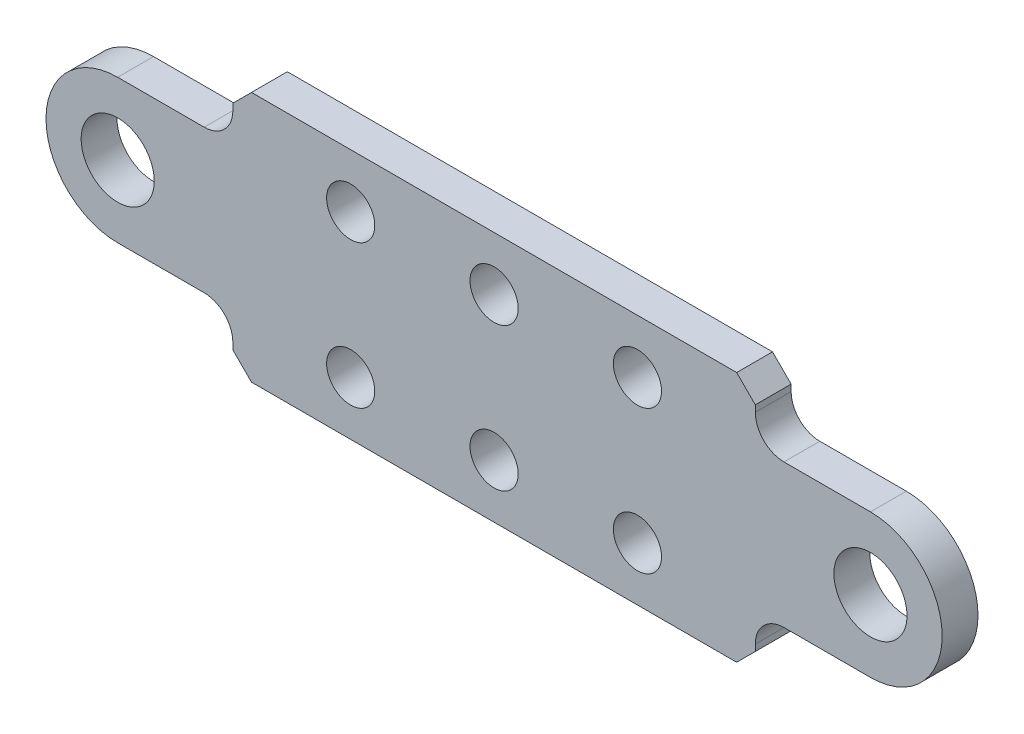
ISO-10303-21;
HEADER;
FILE_DESCRIPTION(('STEP AP214'),'2;1');
FILE_NAME('part.step','',(''),(''),'','','');
FILE_SCHEMA(('AUTOMOTIVE_DESIGN { 1 0 10303 214 1 1 1 1 }'));
ENDSEC;
DATA;
#1=APPLICATION_CONTEXT('core data for automotive mechanical design processes');
#2=APPLICATION_PROTOCOL_DEFINITION('international standard','automotive_design',2000,#1);
#3=PRODUCT_CONTEXT('',#1,'mechanical');
#4=PRODUCT('Part','Part','',(#3));
#5=PRODUCT_RELATED_PRODUCT_CATEGORY('part','',(#4));
#6=PRODUCT_DEFINITION_FORMATION('','',#4);
#7=PRODUCT_DEFINITION_CONTEXT('part definition',#1,'design');
#8=PRODUCT_DEFINITION('design','',#6,#7);
#9=PRODUCT_DEFINITION_SHAPE('','',#8);
#10=(LENGTH_UNIT() NAMED_UNIT(*) SI_UNIT(.MILLI.,.METRE.));
#11=(NAMED_UNIT(*) PLANE_ANGLE_UNIT() SI_UNIT($,.RADIAN.));
#12=(NAMED_UNIT(*) SI_UNIT($,.STERADIAN.) SOLID_ANGLE_UNIT());
#13=UNCERTAINTY_MEASURE_WITH_UNIT(LENGTH_MEASURE(1.E-05),#10,'distance_accuracy_value','');
#14=(GEOMETRIC_REPRESENTATION_CONTEXT(3) GLOBAL_UNCERTAINTY_ASSIGNED_CONTEXT((#13)) GLOBAL_UNIT_ASSIGNED_CONTEXT((#10,
#11,#12)) REPRESENTATION_CONTEXT('',''));
#15=CARTESIAN_POINT('',(0.,0.,0.));
#16=DIRECTION('',(0.,0.,1.));
#17=DIRECTION('',(1.,0.,0.));
#18=AXIS2_PLACEMENT_3D('',#15,#16,#17);
#19=CARTESIAN_POINT('',(23.1375955865752,0.,0.));
#20=DIRECTION('',(-1.,0.,0.));
#21=DIRECTION('',(0.,0.,1.));
#22=AXIS2_PLACEMENT_3D('',#19,#20,#21);
#23=PLANE('',#22);
#24=DIRECTION('',(0.,0.,-1.));
#25=VECTOR('',#24,1.);
#26=CARTESIAN_POINT('',(23.1375955865752,-8.89,0.));
#27=LINE('',#26,#25);
#28=CARTESIAN_POINT('',(23.1375955865752,-8.89,0.));
#29=VERTEX_POINT('',#28);
#30=CARTESIAN_POINT('',(23.1375955865752,-8.89,3.175));
#31=VERTEX_POINT('',#30);
#32=EDGE_CURVE('E167',#29,#31,#27,.F.);
#33=ORIENTED_EDGE('',*,*,#32,.T.);
#34=DIRECTION('',(0.,1.,0.));
#35=VECTOR('',#34,1.);
#36=CARTESIAN_POINT('',(23.1375955865752,0.,3.175));
#37=LINE('',#36,#35);
#38=CARTESIAN_POINT('',(23.1375955865752,-9.4615,3.175));
#39=VERTEX_POINT('',#38);
#40=EDGE_CURVE('E151',#39,#31,#37,.T.);
#41=ORIENTED_EDGE('',*,*,#40,.F.);
#42=DIRECTION('',(0.,0.,1.));
#43=VECTOR('',#42,1.);
#44=CARTESIAN_POINT('',(23.1375955865752,-9.4615,3.175));
#45=LINE('',#44,#43);
#46=CARTESIAN_POINT('',(23.1375955865752,-9.4615,0.));
#47=VERTEX_POINT('',#46);
#48=EDGE_CURVE('E185',#39,#47,#45,.F.);
#49=ORIENTED_EDGE('',*,*,#48,.T.);
#50=DIRECTION('',(0.,1.,0.));
#51=VECTOR('',#50,1.);
#52=CARTESIAN_POINT('',(23.1375955865752,0.,0.));
#53=LINE('',#52,#51);
#54=EDGE_CURVE('E219',#29,#47,#53,.F.);
#55=ORIENTED_EDGE('',*,*,#54,.F.);
#56=EDGE_LOOP('',(#33,#41,#49,#55));
#57=FACE_BOUND('',#56,.T.);
#58=ADVANCED_FACE('F17',(#57),#23,.F.);
#59=CARTESIAN_POINT('',(23.1375955865752,0.,0.));
#60=DIRECTION('',(1.,0.,0.));
#61=DIRECTION('',(0.,0.,-1.));
#62=AXIS2_PLACEMENT_3D('',#59,#60,#61);
#63=PLANE('',#62);
#64=DIRECTION('',(0.,1.,0.));
#65=VECTOR('',#64,1.);
#66=CARTESIAN_POINT('',(23.1375955865752,0.,0.));
#67=LINE('',#66,#65);
#68=CARTESIAN_POINT('',(23.1375955865752,8.89,0.));
#69=VERTEX_POINT('',#68);
#70=CARTESIAN_POINT('',(23.1375955865752,9.4615,0.));
#71=VERTEX_POINT('',#70);
#72=EDGE_CURVE('E215',#69,#71,#67,.T.);
#73=ORIENTED_EDGE('',*,*,#72,.T.);
#74=DIRECTION('',(0.,0.,1.));
#75=VECTOR('',#74,1.);
#76=CARTESIAN_POINT('',(23.1375955865752,9.4615,0.));
#77=LINE('',#76,#75);
#78=CARTESIAN_POINT('',(23.1375955865752,9.4615,3.175));
#79=VERTEX_POINT('',#78);
#80=EDGE_CURVE('E242',#71,#79,#77,.T.);
#81=ORIENTED_EDGE('',*,*,#80,.T.);
#82=DIRECTION('',(0.,1.,0.));
#83=VECTOR('',#82,1.);
#84=CARTESIAN_POINT('',(23.1375955865752,0.,3.175));
#85=LINE('',#84,#83);
#86=CARTESIAN_POINT('',(23.1375955865752,8.89,3.175));
#87=VERTEX_POINT('',#86);
#88=EDGE_CURVE('E188',#87,#79,#85,.T.);
#89=ORIENTED_EDGE('',*,*,#88,.F.);
#90=DIRECTION('',(0.,0.,-1.));
#91=VECTOR('',#90,1.);
#92=CARTESIAN_POINT('',(23.1375955865752,8.89,0.));
#93=LINE('',#92,#91);
#94=EDGE_CURVE('E247',#87,#69,#93,.T.);
#95=ORIENTED_EDGE('',*,*,#94,.T.);
#96=EDGE_LOOP('',(#73,#81,#89,#95));
#97=FACE_BOUND('',#96,.T.);
#98=ADVANCED_FACE('F660',(#97),#63,.T.);
#99=CARTESIAN_POINT('',(-23.1375955865752,0.,0.));
#100=DIRECTION('',(1.,0.,0.));
#101=DIRECTION('',(0.,0.,-1.));
#102=AXIS2_PLACEMENT_3D('',#99,#100,#101);
#103=PLANE('',#102);
#104=DIRECTION('',(0.,0.,-1.));
#105=VECTOR('',#104,1.);
#106=CARTESIAN_POINT('',(-23.1375955865752,8.89,0.));
#107=LINE('',#106,#105);
#108=CARTESIAN_POINT('',(-23.1375955865752,8.89,0.));
#109=VERTEX_POINT('',#108);
#110=CARTESIAN_POINT('',(-23.1375955865752,8.89,3.175));
#111=VERTEX_POINT('',#110);
#112=EDGE_CURVE('E342',#109,#111,#107,.F.);
#113=ORIENTED_EDGE('',*,*,#112,.T.);
#114=DIRECTION('',(0.,1.,0.));
#115=VECTOR('',#114,1.);
#116=CARTESIAN_POINT('',(-23.1375955865752,0.,3.175));
#117=LINE('',#116,#115);
#118=CARTESIAN_POINT('',(-23.1375955865752,9.4615,3.175));
#119=VERTEX_POINT('',#118);
#120=EDGE_CURVE('E186',#119,#111,#117,.F.);
#121=ORIENTED_EDGE('',*,*,#120,.F.);
#122=DIRECTION('',(0.,0.,1.));
#123=VECTOR('',#122,1.);
#124=CARTESIAN_POINT('',(-23.1375955865752,9.4615,3.175));
#125=LINE('',#124,#123);
#126=CARTESIAN_POINT('',(-23.1375955865752,9.4615,0.));
#127=VERTEX_POINT('',#126);
#128=EDGE_CURVE('E228',#127,#119,#125,.T.);
#129=ORIENTED_EDGE('',*,*,#128,.F.);
#130=DIRECTION('',(0.,1.,0.));
#131=VECTOR('',#130,1.);
#132=CARTESIAN_POINT('',(-23.1375955865752,0.,0.));
#133=LINE('',#132,#131);
#134=EDGE_CURVE('E203',#109,#127,#133,.T.);
#135=ORIENTED_EDGE('',*,*,#134,.F.);
#136=EDGE_LOOP('',(#113,#121,#129,#135));
#137=FACE_BOUND('',#136,.T.);
#138=ADVANCED_FACE('F651',(#137),#103,.F.);
#139=CARTESIAN_POINT('',(-23.1375955865752,0.,0.));
#140=DIRECTION('',(-1.,0.,0.));
#141=DIRECTION('',(0.,0.,1.));
#142=AXIS2_PLACEMENT_3D('',#139,#140,#141);
#143=PLANE('',#142);
#144=DIRECTION('',(0.,1.,0.));
#145=VECTOR('',#144,1.);
#146=CARTESIAN_POINT('',(-23.1375955865752,0.,0.));
#147=LINE('',#146,#145);
#148=CARTESIAN_POINT('',(-23.1375955865752,-8.89,0.));
#149=VERTEX_POINT('',#148);
#150=CARTESIAN_POINT('',(-23.1375955865752,-9.4615,0.));
#151=VERTEX_POINT('',#150);
#152=EDGE_CURVE('E199',#149,#151,#147,.F.);
#153=ORIENTED_EDGE('',*,*,#152,.T.);
#154=DIRECTION('',(0.,0.,1.));
#155=VECTOR('',#154,1.);
#156=CARTESIAN_POINT('',(-23.1375955865752,-9.4615,0.));
#157=LINE('',#156,#155);
#158=CARTESIAN_POINT('',(-23.1375955865752,-9.4615,3.175));
#159=VERTEX_POINT('',#158);
#160=EDGE_CURVE('E262',#159,#151,#157,.F.);
#161=ORIENTED_EDGE('',*,*,#160,.F.);
#162=DIRECTION('',(0.,1.,0.));
#163=VECTOR('',#162,1.);
#164=CARTESIAN_POINT('',(-23.1375955865752,0.,3.175));
#165=LINE('',#164,#163);
#166=CARTESIAN_POINT('',(-23.1375955865752,-8.89,3.175));
#167=VERTEX_POINT('',#166);
#168=EDGE_CURVE('E195',#167,#159,#165,.F.);
#169=ORIENTED_EDGE('',*,*,#168,.F.);
#170=DIRECTION('',(0.,0.,-1.));
#171=VECTOR('',#170,1.);
#172=CARTESIAN_POINT('',(-23.1375955865752,-8.89,0.));
#173=LINE('',#172,#171);
#174=EDGE_CURVE('E263',#167,#149,#173,.T.);
#175=ORIENTED_EDGE('',*,*,#174,.T.);
#176=EDGE_LOOP('',(#153,#161,#169,#175));
#177=FACE_BOUND('',#176,.T.);
#178=ADVANCED_FACE('F385',(#177),#143,.T.);
#179=CARTESIAN_POINT('',(0.,0.,3.175));
#180=DIRECTION('',(0.,0.,1.));
#181=DIRECTION('',(1.,0.,0.));
#182=AXIS2_PLACEMENT_3D('',#179,#180,#181);
#183=PLANE('',#182);
#184=DIRECTION('',(1.,0.,0.));
#185=VECTOR('',#184,1.);
#186=CARTESIAN_POINT('',(0.,6.35,3.175));
#187=LINE('',#186,#185);
#188=CARTESIAN_POINT('',(-25.6775955865752,6.35,3.175));
#189=VERTEX_POINT('',#188);
#190=CARTESIAN_POINT('',(-33.3375,6.35,3.175));
#191=VERTEX_POINT('',#190);
#192=EDGE_CURVE('E210',#189,#191,#187,.F.);
#193=ORIENTED_EDGE('',*,*,#192,.T.);
#194=CARTESIAN_POINT('',(-33.3375,0.,3.175));
#195=DIRECTION('',(0.,0.,-1.));
#196=DIRECTION('',(-1.,0.,0.));
#197=AXIS2_PLACEMENT_3D('',#194,#195,#196);
#198=CIRCLE('',#197,6.35);
#199=CARTESIAN_POINT('',(-33.3375,-6.35,3.175));
#200=VERTEX_POINT('',#199);
#201=EDGE_CURVE('E209',#200,#191,#198,.T.);
#202=ORIENTED_EDGE('',*,*,#201,.F.);
#203=DIRECTION('',(1.,0.,0.));
#204=VECTOR('',#203,1.);
#205=CARTESIAN_POINT('',(0.,-6.35,3.175));
#206=LINE('',#205,#204);
#207=CARTESIAN_POINT('',(-25.6775955865752,-6.34999999999999,3.175));
#208=VERTEX_POINT('',#207);
#209=EDGE_CURVE('E206',#208,#200,#206,.F.);
#210=ORIENTED_EDGE('',*,*,#209,.F.);
#211=CARTESIAN_POINT('',(-25.6775955865752,-8.89,3.175));
#212=DIRECTION('',(0.,0.,-1.));
#213=DIRECTION('',(-1.,0.,0.));
#214=AXIS2_PLACEMENT_3D('',#211,#212,#213);
#215=CIRCLE('',#214,2.54);
#216=EDGE_CURVE('E335',#208,#167,#215,.T.);
#217=ORIENTED_EDGE('',*,*,#216,.T.);
#218=ORIENTED_EDGE('',*,*,#168,.T.);
#219=DIRECTION('',(0.707106781186548,-0.707106781186548,0.));
#220=VECTOR('',#219,1.);
#221=CARTESIAN_POINT('',(-23.1375955865752,-9.4615,3.175));
#222=LINE('',#221,#220);
#223=CARTESIAN_POINT('',(-21.4865955865752,-11.1125,3.175));
#224=VERTEX_POINT('',#223);
#225=EDGE_CURVE('E259',#224,#159,#222,.F.);
#226=ORIENTED_EDGE('',*,*,#225,.F.);
#227=DIRECTION('',(1.,0.,0.));
#228=VECTOR('',#227,1.);
#229=CARTESIAN_POINT('',(0.,-11.1125,3.175));
#230=LINE('',#229,#228);
#231=CARTESIAN_POINT('',(21.4865955865752,-11.1125,3.175));
#232=VERTEX_POINT('',#231);
#233=EDGE_CURVE('E334',#224,#232,#230,.T.);
#234=ORIENTED_EDGE('',*,*,#233,.T.);
#235=DIRECTION('',(-0.707106781186548,-0.707106781186548,0.));
#236=VECTOR('',#235,1.);
#237=CARTESIAN_POINT('',(21.4865955865752,-11.1125,3.175));
#238=LINE('',#237,#236);
#239=EDGE_CURVE('E252',#232,#39,#238,.F.);
#240=ORIENTED_EDGE('',*,*,#239,.T.);
#241=ORIENTED_EDGE('',*,*,#40,.T.);
#242=CARTESIAN_POINT('',(25.6775955865752,-8.89,3.175));
#243=DIRECTION('',(0.,0.,-1.));
#244=DIRECTION('',(-1.,0.,0.));
#245=AXIS2_PLACEMENT_3D('',#242,#243,#244);
#246=CIRCLE('',#245,2.54);
#247=CARTESIAN_POINT('',(25.6775955865752,-6.35,3.175));
#248=VERTEX_POINT('',#247);
#249=EDGE_CURVE('E154',#31,#248,#246,.T.);
#250=ORIENTED_EDGE('',*,*,#249,.T.);
#251=DIRECTION('',(1.,0.,0.));
#252=VECTOR('',#251,1.);
#253=CARTESIAN_POINT('',(0.,-6.35,3.175));
#254=LINE('',#253,#252);
#255=CARTESIAN_POINT('',(33.3375,-6.34999999999999,3.175));
#256=VERTEX_POINT('',#255);
#257=EDGE_CURVE('E160',#248,#256,#254,.T.);
#258=ORIENTED_EDGE('',*,*,#257,.T.);
#259=CARTESIAN_POINT('',(33.3375,0.,3.175));
#260=DIRECTION('',(0.,0.,-1.));
#261=DIRECTION('',(-1.,0.,0.));
#262=AXIS2_PLACEMENT_3D('',#259,#260,#261);
#263=CIRCLE('',#262,6.35);
#264=CARTESIAN_POINT('',(33.3375,6.35,3.175));
#265=VERTEX_POINT('',#264);
#266=EDGE_CURVE('E174',#265,#256,#263,.T.);
#267=ORIENTED_EDGE('',*,*,#266,.F.);
#268=DIRECTION('',(1.,0.,0.));
#269=VECTOR('',#268,1.);
#270=CARTESIAN_POINT('',(0.,6.35,3.175));
#271=LINE('',#270,#269);
#272=CARTESIAN_POINT('',(25.6775955865752,6.34999999999999,3.175));
#273=VERTEX_POINT('',#272);
#274=EDGE_CURVE('E222',#273,#265,#271,.T.);
#275=ORIENTED_EDGE('',*,*,#274,.F.);
#276=CARTESIAN_POINT('',(25.6775955865752,8.89,3.175));
#277=DIRECTION('',(0.,0.,-1.));
#278=DIRECTION('',(-1.,0.,0.));
#279=AXIS2_PLACEMENT_3D('',#276,#277,#278);
#280=CIRCLE('',#279,2.54);
#281=EDGE_CURVE('E343',#273,#87,#280,.T.);
#282=ORIENTED_EDGE('',*,*,#281,.T.);
#283=ORIENTED_EDGE('',*,*,#88,.T.);
#284=DIRECTION('',(0.707106781186548,-0.707106781186548,0.));
#285=VECTOR('',#284,1.);
#286=CARTESIAN_POINT('',(23.1375955865752,9.4615,3.175));
#287=LINE('',#286,#285);
#288=CARTESIAN_POINT('',(21.4865955865752,11.1125,3.175));
#289=VERTEX_POINT('',#288);
#290=EDGE_CURVE('E238',#79,#289,#287,.F.);
#291=ORIENTED_EDGE('',*,*,#290,.T.);
#292=DIRECTION('',(1.,0.,0.));
#293=VECTOR('',#292,1.);
#294=CARTESIAN_POINT('',(0.,11.1125,3.175));
#295=LINE('',#294,#293);
#296=CARTESIAN_POINT('',(-21.4865955865752,11.1125,3.175));
#297=VERTEX_POINT('',#296);
#298=EDGE_CURVE('E241',#297,#289,#295,.T.);
#299=ORIENTED_EDGE('',*,*,#298,.F.);
#300=DIRECTION('',(-0.707106781186548,-0.707106781186548,0.));
#301=VECTOR('',#300,1.);
#302=CARTESIAN_POINT('',(-21.4865955865752,11.1125,3.175));
#303=LINE('',#302,#301);
#304=EDGE_CURVE('E230',#119,#297,#303,.F.);
#305=ORIENTED_EDGE('',*,*,#304,.F.);
#306=ORIENTED_EDGE('',*,*,#120,.T.);
#307=CARTESIAN_POINT('',(-25.6775955865752,8.89,3.175));
#308=DIRECTION('',(0.,0.,-1.));
#309=DIRECTION('',(-1.,0.,0.));
#310=AXIS2_PLACEMENT_3D('',#307,#308,#309);
#311=CIRCLE('',#310,2.54);
#312=EDGE_CURVE('E340',#111,#189,#311,.T.);
#313=ORIENTED_EDGE('',*,*,#312,.T.);
#314=EDGE_LOOP('',(#193,#202,#210,#217,#218,#226,#234,#240,#241,#250,#258,#267,#275,#282,#283,
#291,#299,#305,#306,#313));
#315=FACE_BOUND('',#314,.T.);
#316=CARTESIAN_POINT('',(33.3375,0.,3.175));
#317=DIRECTION('',(0.,0.,-1.));
#318=DIRECTION('',(-1.,0.,0.));
#319=AXIS2_PLACEMENT_3D('',#316,#317,#318);
#320=CIRCLE('',#319,3.2385);
#321=CARTESIAN_POINT('',(30.099,0.,3.175));
#322=VERTEX_POINT('',#321);
#323=EDGE_CURVE('E256',#322,#322,#320,.T.);
#324=ORIENTED_EDGE('',*,*,#323,.T.);
#325=EDGE_LOOP('',(#324));
#326=FACE_BOUND('',#325,.T.);
#327=CARTESIAN_POINT('',(-33.3375,0.,3.175));
#328=DIRECTION('',(0.,0.,-1.));
#329=DIRECTION('',(-1.,0.,0.));
#330=AXIS2_PLACEMENT_3D('',#327,#328,#329);
#331=CIRCLE('',#330,3.2385);
#332=CARTESIAN_POINT('',(-36.576,0.,3.175));
#333=VERTEX_POINT('',#332);
#334=EDGE_CURVE('E350',#333,#333,#331,.T.);
#335=ORIENTED_EDGE('',*,*,#334,.T.);
#336=EDGE_LOOP('',(#335));
#337=FACE_BOUND('',#336,.T.);
#338=CARTESIAN_POINT('',(-12.7,-6.35,3.175));
#339=DIRECTION('',(0.,0.,-1.));
#340=DIRECTION('',(-1.,0.,0.));
#341=AXIS2_PLACEMENT_3D('',#338,#339,#340);
#342=CIRCLE('',#341,2.1336);
#343=CARTESIAN_POINT('',(-14.8336,-6.35,3.175));
#344=VERTEX_POINT('',#343);
#345=EDGE_CURVE('E353',#344,#344,#342,.T.);
#346=ORIENTED_EDGE('',*,*,#345,.T.);
#347=EDGE_LOOP('',(#346));
#348=FACE_BOUND('',#347,.T.);
#349=CARTESIAN_POINT('',(0.,-6.35,3.175));
#350=DIRECTION('',(0.,0.,-1.));
#351=DIRECTION('',(-1.,0.,0.));
#352=AXIS2_PLACEMENT_3D('',#349,#350,#351);
#353=CIRCLE('',#352,2.1336);
#354=CARTESIAN_POINT('',(-2.13360000000001,-6.35,3.175));
#355=VERTEX_POINT('',#354);
#356=EDGE_CURVE('E356',#355,#355,#353,.T.);
#357=ORIENTED_EDGE('',*,*,#356,.T.);
#358=EDGE_LOOP('',(#357));
#359=FACE_BOUND('',#358,.T.);
#360=CARTESIAN_POINT('',(12.7,-6.35,3.175));
#361=DIRECTION('',(0.,0.,-1.));
#362=DIRECTION('',(-1.,0.,0.));
#363=AXIS2_PLACEMENT_3D('',#360,#361,#362);
#364=CIRCLE('',#363,2.1336);
#365=CARTESIAN_POINT('',(10.5664,-6.35,3.175));
#366=VERTEX_POINT('',#365);
#367=EDGE_CURVE('E359',#366,#366,#364,.T.);
#368=ORIENTED_EDGE('',*,*,#367,.T.);
#369=EDGE_LOOP('',(#368));
#370=FACE_BOUND('',#369,.T.);
#371=CARTESIAN_POINT('',(12.7,6.35,3.175));
#372=DIRECTION('',(0.,0.,-1.));
#373=DIRECTION('',(-1.,0.,0.));
#374=AXIS2_PLACEMENT_3D('',#371,#372,#373);
#375=CIRCLE('',#374,2.1336);
#376=CARTESIAN_POINT('',(10.5664,6.35,3.175));
#377=VERTEX_POINT('',#376);
#378=EDGE_CURVE('E362',#377,#377,#375,.T.);
#379=ORIENTED_EDGE('',*,*,#378,.T.);
#380=EDGE_LOOP('',(#379));
#381=FACE_BOUND('',#380,.T.);
#382=CARTESIAN_POINT('',(0.,6.35,3.175));
#383=DIRECTION('',(0.,0.,-1.));
#384=DIRECTION('',(-1.,0.,0.));
#385=AXIS2_PLACEMENT_3D('',#382,#383,#384);
#386=CIRCLE('',#385,2.1336);
#387=CARTESIAN_POINT('',(-2.13360000000001,6.35,3.175));
#388=VERTEX_POINT('',#387);
#389=EDGE_CURVE('E364',#388,#388,#386,.T.);
#390=ORIENTED_EDGE('',*,*,#389,.T.);
#391=EDGE_LOOP('',(#390));
#392=FACE_BOUND('',#391,.T.);
#393=CARTESIAN_POINT('',(-12.7,6.35,3.175));
#394=DIRECTION('',(0.,0.,-1.));
#395=DIRECTION('',(-1.,0.,0.));
#396=AXIS2_PLACEMENT_3D('',#393,#394,#395);
#397=CIRCLE('',#396,2.1336);
#398=CARTESIAN_POINT('',(-14.8336,6.35,3.175));
#399=VERTEX_POINT('',#398);
#400=EDGE_CURVE('E20',#399,#399,#397,.T.);
#401=ORIENTED_EDGE('',*,*,#400,.T.);
#402=EDGE_LOOP('',(#401));
#403=FACE_BOUND('',#402,.T.);
#404=ADVANCED_FACE('F157',(#315,#326,#337,#348,#359,#370,#381,#392,#403),#183,.T.);
#405=CARTESIAN_POINT('',(-12.7,6.35,3.175));
#406=DIRECTION('',(0.,0.,-1.));
#407=DIRECTION('',(-1.,0.,0.));
#408=AXIS2_PLACEMENT_3D('',#405,#406,#407);
#409=CYLINDRICAL_SURFACE('',#408,2.1336);
#410=CARTESIAN_POINT('',(-12.7,6.35,0.));
#411=DIRECTION('',(0.,0.,-1.));
#412=DIRECTION('',(-1.,0.,0.));
#413=AXIS2_PLACEMENT_3D('',#410,#411,#412);
#414=CIRCLE('',#413,2.1336);
#415=CARTESIAN_POINT('',(-14.8336,6.35,0.));
#416=VERTEX_POINT('',#415);
#417=EDGE_CURVE('E331',#416,#416,#414,.T.);
#418=ORIENTED_EDGE('',*,*,#417,.T.);
#419=EDGE_LOOP('',(#418));
#420=FACE_BOUND('',#419,.T.);
#421=ORIENTED_EDGE('',*,*,#400,.F.);
#422=EDGE_LOOP('',(#421));
#423=FACE_BOUND('',#422,.T.);
#424=ADVANCED_FACE('F372',(#420,#423),#409,.F.);
#425=CARTESIAN_POINT('',(0.,6.35,3.175));
#426=DIRECTION('',(0.,0.,-1.));
#427=DIRECTION('',(-1.,0.,0.));
#428=AXIS2_PLACEMENT_3D('',#425,#426,#427);
#429=CYLINDRICAL_SURFACE('',#428,2.1336);
#430=CARTESIAN_POINT('',(0.,6.35,0.));
#431=DIRECTION('',(0.,0.,-1.));
#432=DIRECTION('',(-1.,0.,0.));
#433=AXIS2_PLACEMENT_3D('',#430,#431,#432);
#434=CIRCLE('',#433,2.1336);
#435=CARTESIAN_POINT('',(-2.13360000000001,6.35,0.));
#436=VERTEX_POINT('',#435);
#437=EDGE_CURVE('E328',#436,#436,#434,.T.);
#438=ORIENTED_EDGE('',*,*,#437,.T.);
#439=EDGE_LOOP('',(#438));
#440=FACE_BOUND('',#439,.T.);
#441=ORIENTED_EDGE('',*,*,#389,.F.);
#442=EDGE_LOOP('',(#441));
#443=FACE_BOUND('',#442,.T.);
#444=ADVANCED_FACE('F374',(#440,#443),#429,.F.);
#445=CARTESIAN_POINT('',(12.7,6.35,3.175));
#446=DIRECTION('',(0.,0.,-1.));
#447=DIRECTION('',(-1.,0.,0.));
#448=AXIS2_PLACEMENT_3D('',#445,#446,#447);
#449=CYLINDRICAL_SURFACE('',#448,2.1336);
#450=CARTESIAN_POINT('',(12.7,6.35,0.));
#451=DIRECTION('',(0.,0.,-1.));
#452=DIRECTION('',(-1.,0.,0.));
#453=AXIS2_PLACEMENT_3D('',#450,#451,#452);
#454=CIRCLE('',#453,2.1336);
#455=CARTESIAN_POINT('',(10.5664,6.35,0.));
#456=VERTEX_POINT('',#455);
#457=EDGE_CURVE('E325',#456,#456,#454,.T.);
#458=ORIENTED_EDGE('',*,*,#457,.T.);
#459=EDGE_LOOP('',(#458));
#460=FACE_BOUND('',#459,.T.);
#461=ORIENTED_EDGE('',*,*,#378,.F.);
#462=EDGE_LOOP('',(#461));
#463=FACE_BOUND('',#462,.T.);
#464=ADVANCED_FACE('F382',(#460,#463),#449,.F.);
#465=CARTESIAN_POINT('',(12.7,-6.35,3.175));
#466=DIRECTION('',(0.,0.,-1.));
#467=DIRECTION('',(-1.,0.,0.));
#468=AXIS2_PLACEMENT_3D('',#465,#466,#467);
#469=CYLINDRICAL_SURFACE('',#468,2.1336);
#470=CARTESIAN_POINT('',(12.7,-6.35,0.));
#471=DIRECTION('',(0.,0.,-1.));
#472=DIRECTION('',(-1.,0.,0.));
#473=AXIS2_PLACEMENT_3D('',#470,#471,#472);
#474=CIRCLE('',#473,2.1336);
#475=CARTESIAN_POINT('',(10.5664,-6.35,0.));
#476=VERTEX_POINT('',#475);
#477=EDGE_CURVE('E322',#476,#476,#474,.T.);
#478=ORIENTED_EDGE('',*,*,#477,.T.);
#479=EDGE_LOOP('',(#478));
#480=FACE_BOUND('',#479,.T.);
#481=ORIENTED_EDGE('',*,*,#367,.F.);
#482=EDGE_LOOP('',(#481));
#483=FACE_BOUND('',#482,.T.);
#484=ADVANCED_FACE('F470',(#480,#483),#469,.F.);
#485=CARTESIAN_POINT('',(0.,-6.35,3.175));
#486=DIRECTION('',(0.,0.,-1.));
#487=DIRECTION('',(-1.,0.,0.));
#488=AXIS2_PLACEMENT_3D('',#485,#486,#487);
#489=CYLINDRICAL_SURFACE('',#488,2.1336);
#490=CARTESIAN_POINT('',(0.,-6.35,0.));
#491=DIRECTION('',(0.,0.,-1.));
#492=DIRECTION('',(-1.,0.,0.));
#493=AXIS2_PLACEMENT_3D('',#490,#491,#492);
#494=CIRCLE('',#493,2.1336);
#495=CARTESIAN_POINT('',(-2.13360000000001,-6.35,0.));
#496=VERTEX_POINT('',#495);
#497=EDGE_CURVE('E319',#496,#496,#494,.T.);
#498=ORIENTED_EDGE('',*,*,#497,.T.);
#499=EDGE_LOOP('',(#498));
#500=FACE_BOUND('',#499,.T.);
#501=ORIENTED_EDGE('',*,*,#356,.F.);
#502=EDGE_LOOP('',(#501));
#503=FACE_BOUND('',#502,.T.);
#504=ADVANCED_FACE('F466',(#500,#503),#489,.F.);
#505=CARTESIAN_POINT('',(-12.7,-6.35,3.175));
#506=DIRECTION('',(0.,0.,-1.));
#507=DIRECTION('',(-1.,0.,0.));
#508=AXIS2_PLACEMENT_3D('',#505,#506,#507);
#509=CYLINDRICAL_SURFACE('',#508,2.1336);
#510=CARTESIAN_POINT('',(-12.7,-6.35,0.));
#511=DIRECTION('',(0.,0.,-1.));
#512=DIRECTION('',(-1.,0.,0.));
#513=AXIS2_PLACEMENT_3D('',#510,#511,#512);
#514=CIRCLE('',#513,2.1336);
#515=CARTESIAN_POINT('',(-14.8336,-6.35,0.));
#516=VERTEX_POINT('',#515);
#517=EDGE_CURVE('E316',#516,#516,#514,.T.);
#518=ORIENTED_EDGE('',*,*,#517,.T.);
#519=EDGE_LOOP('',(#518));
#520=FACE_BOUND('',#519,.T.);
#521=ORIENTED_EDGE('',*,*,#345,.F.);
#522=EDGE_LOOP('',(#521));
#523=FACE_BOUND('',#522,.T.);
#524=ADVANCED_FACE('F462',(#520,#523),#509,.F.);
#525=CARTESIAN_POINT('',(-33.3375,0.,3.175));
#526=DIRECTION('',(0.,0.,-1.));
#527=DIRECTION('',(-1.,0.,0.));
#528=AXIS2_PLACEMENT_3D('',#525,#526,#527);
#529=CYLINDRICAL_SURFACE('',#528,3.2385);
#530=CARTESIAN_POINT('',(-33.3375,0.,0.));
#531=DIRECTION('',(0.,0.,-1.));
#532=DIRECTION('',(-1.,0.,0.));
#533=AXIS2_PLACEMENT_3D('',#530,#531,#532);
#534=CIRCLE('',#533,3.2385);
#535=CARTESIAN_POINT('',(-36.576,0.,0.));
#536=VERTEX_POINT('',#535);
#537=EDGE_CURVE('E313',#536,#536,#534,.T.);
#538=ORIENTED_EDGE('',*,*,#537,.T.);
#539=EDGE_LOOP('',(#538));
#540=FACE_BOUND('',#539,.T.);
#541=ORIENTED_EDGE('',*,*,#334,.F.);
#542=EDGE_LOOP('',(#541));
#543=FACE_BOUND('',#542,.T.);
#544=ADVANCED_FACE('F458',(#540,#543),#529,.F.);
#545=CARTESIAN_POINT('',(33.3375,0.,3.175));
#546=DIRECTION('',(0.,0.,-1.));
#547=DIRECTION('',(-1.,0.,0.));
#548=AXIS2_PLACEMENT_3D('',#545,#546,#547);
#549=CYLINDRICAL_SURFACE('',#548,3.2385);
#550=CARTESIAN_POINT('',(33.3375,0.,0.));
#551=DIRECTION('',(0.,0.,-1.));
#552=DIRECTION('',(-1.,0.,0.));
#553=AXIS2_PLACEMENT_3D('',#550,#551,#552);
#554=CIRCLE('',#553,3.2385);
#555=CARTESIAN_POINT('',(30.099,0.,0.));
#556=VERTEX_POINT('',#555);
#557=EDGE_CURVE('E292',#556,#556,#554,.T.);
#558=ORIENTED_EDGE('',*,*,#557,.T.);
#559=EDGE_LOOP('',(#558));
#560=FACE_BOUND('',#559,.T.);
#561=ORIENTED_EDGE('',*,*,#323,.F.);
#562=EDGE_LOOP('',(#561));
#563=FACE_BOUND('',#562,.T.);
#564=ADVANCED_FACE('F454',(#560,#563),#549,.F.);
#565=CARTESIAN_POINT('',(21.4865955865752,-11.1125,3.175));
#566=DIRECTION('',(-0.707106781186548,0.707106781186548,0.));
#567=DIRECTION('',(-0.707106781186548,-0.707106781186548,0.));
#568=AXIS2_PLACEMENT_3D('',#565,#566,#567);
#569=PLANE('',#568);
#570=ORIENTED_EDGE('',*,*,#48,.F.);
#571=ORIENTED_EDGE('',*,*,#239,.F.);
#572=DIRECTION('',(0.,0.,1.));
#573=VECTOR('',#572,1.);
#574=CARTESIAN_POINT('',(21.4865955865752,-11.1125,3.175));
#575=LINE('',#574,#573);
#576=CARTESIAN_POINT('',(21.4865955865752,-11.1125,0.));
#577=VERTEX_POINT('',#576);
#578=EDGE_CURVE('E268',#232,#577,#575,.F.);
#579=ORIENTED_EDGE('',*,*,#578,.T.);
#580=DIRECTION('',(0.707106781186547,0.707106781186547,0.));
#581=VECTOR('',#580,1.);
#582=CARTESIAN_POINT('',(21.4865955865752,-11.1125,0.));
#583=LINE('',#582,#581);
#584=EDGE_CURVE('E289',#577,#47,#583,.T.);
#585=ORIENTED_EDGE('',*,*,#584,.T.);
#586=EDGE_LOOP('',(#570,#571,#579,#585));
#587=FACE_BOUND('',#586,.T.);
#588=ADVANCED_FACE('F451',(#587),#569,.F.);
#589=CARTESIAN_POINT('',(25.6775955865752,-8.89,0.));
#590=DIRECTION('',(0.,0.,-1.));
#591=DIRECTION('',(-1.,0.,0.));
#592=AXIS2_PLACEMENT_3D('',#589,#590,#591);
#593=CYLINDRICAL_SURFACE('',#592,2.54);
#594=DIRECTION('',(0.,0.,1.));
#595=VECTOR('',#594,1.);
#596=CARTESIAN_POINT('',(25.6775955865752,-6.35,0.));
#597=LINE('',#596,#595);
#598=CARTESIAN_POINT('',(25.6775955865752,-6.35,0.));
#599=VERTEX_POINT('',#598);
#600=EDGE_CURVE('E166',#599,#248,#597,.T.);
#601=ORIENTED_EDGE('',*,*,#600,.T.);
#602=ORIENTED_EDGE('',*,*,#249,.F.);
#603=ORIENTED_EDGE('',*,*,#32,.F.);
#604=CARTESIAN_POINT('',(25.6775955865752,-8.89,0.));
#605=DIRECTION('',(0.,0.,-1.));
#606=DIRECTION('',(-1.,0.,0.));
#607=AXIS2_PLACEMENT_3D('',#604,#605,#606);
#608=CIRCLE('',#607,2.54);
#609=EDGE_CURVE('E179',#29,#599,#608,.T.);
#610=ORIENTED_EDGE('',*,*,#609,.T.);
#611=EDGE_LOOP('',(#601,#602,#603,#610));
#612=FACE_BOUND('',#611,.T.);
#613=ADVANCED_FACE('F177',(#612),#593,.F.);
#614=CARTESIAN_POINT('',(0.,-6.35,0.));
#615=DIRECTION('',(0.,1.,0.));
#616=DIRECTION('',(0.,0.,1.));
#617=AXIS2_PLACEMENT_3D('',#614,#615,#616);
#618=PLANE('',#617);
#619=ORIENTED_EDGE('',*,*,#600,.F.);
#620=DIRECTION('',(1.,0.,0.));
#621=VECTOR('',#620,1.);
#622=CARTESIAN_POINT('',(0.,-6.35,0.));
#623=LINE('',#622,#621);
#624=CARTESIAN_POINT('',(33.3375,-6.34999999999999,0.));
#625=VERTEX_POINT('',#624);
#626=EDGE_CURVE('E309',#599,#625,#623,.T.);
#627=ORIENTED_EDGE('',*,*,#626,.T.);
#628=DIRECTION('',(0.,0.,-1.));
#629=VECTOR('',#628,1.);
#630=CARTESIAN_POINT('',(33.3375,-6.34999999999999,3.175));
#631=LINE('',#630,#629);
#632=EDGE_CURVE('E173',#256,#625,#631,.T.);
#633=ORIENTED_EDGE('',*,*,#632,.F.);
#634=ORIENTED_EDGE('',*,*,#257,.F.);
#635=EDGE_LOOP('',(#619,#627,#633,#634));
#636=FACE_BOUND('',#635,.T.);
#637=ADVANCED_FACE('F170',(#636),#618,.F.);
#638=CARTESIAN_POINT('',(33.3375,0.,3.175));
#639=DIRECTION('',(0.,0.,-1.));
#640=DIRECTION('',(-1.,0.,0.));
#641=AXIS2_PLACEMENT_3D('',#638,#639,#640);
#642=CYLINDRICAL_SURFACE('',#641,6.35);
#643=ORIENTED_EDGE('',*,*,#266,.T.);
#644=ORIENTED_EDGE('',*,*,#632,.T.);
#645=CARTESIAN_POINT('',(33.3375,0.,0.));
#646=DIRECTION('',(0.,0.,-1.));
#647=DIRECTION('',(-1.,0.,0.));
#648=AXIS2_PLACEMENT_3D('',#645,#646,#647);
#649=CIRCLE('',#648,6.35);
#650=CARTESIAN_POINT('',(33.3375,6.35,0.));
#651=VERTEX_POINT('',#650);
#652=EDGE_CURVE('E306',#625,#651,#649,.F.);
#653=ORIENTED_EDGE('',*,*,#652,.T.);
#654=DIRECTION('',(0.,0.,1.));
#655=VECTOR('',#654,1.);
#656=CARTESIAN_POINT('',(33.3375,6.35,0.));
#657=LINE('',#656,#655);
#658=EDGE_CURVE('E223',#265,#651,#657,.F.);
#659=ORIENTED_EDGE('',*,*,#658,.F.);
#660=EDGE_LOOP('',(#643,#644,#653,#659));
#661=FACE_BOUND('',#660,.T.);
#662=ADVANCED_FACE('F442',(#661),#642,.T.);
#663=CARTESIAN_POINT('',(0.,6.35,0.));
#664=DIRECTION('',(0.,1.,0.));
#665=DIRECTION('',(0.,0.,1.));
#666=AXIS2_PLACEMENT_3D('',#663,#664,#665);
#667=PLANE('',#666);
#668=ORIENTED_EDGE('',*,*,#274,.T.);
#669=ORIENTED_EDGE('',*,*,#658,.T.);
#670=DIRECTION('',(1.,0.,0.));
#671=VECTOR('',#670,1.);
#672=CARTESIAN_POINT('',(0.,6.35,0.));
#673=LINE('',#672,#671);
#674=CARTESIAN_POINT('',(25.6775955865752,6.34999999999999,0.));
#675=VERTEX_POINT('',#674);
#676=EDGE_CURVE('E305',#651,#675,#673,.F.);
#677=ORIENTED_EDGE('',*,*,#676,.T.);
#678=DIRECTION('',(0.,0.,-1.));
#679=VECTOR('',#678,1.);
#680=CARTESIAN_POINT('',(25.6775955865752,6.34999999999999,0.));
#681=LINE('',#680,#679);
#682=EDGE_CURVE('E346',#675,#273,#681,.F.);
#683=ORIENTED_EDGE('',*,*,#682,.T.);
#684=EDGE_LOOP('',(#668,#669,#677,#683));
#685=FACE_BOUND('',#684,.T.);
#686=ADVANCED_FACE('F438',(#685),#667,.T.);
#687=CARTESIAN_POINT('',(25.6775955865752,8.89,0.));
#688=DIRECTION('',(0.,0.,-1.));
#689=DIRECTION('',(-1.,0.,0.));
#690=AXIS2_PLACEMENT_3D('',#687,#688,#689);
#691=CYLINDRICAL_SURFACE('',#690,2.54);
#692=ORIENTED_EDGE('',*,*,#94,.F.);
#693=ORIENTED_EDGE('',*,*,#281,.F.);
#694=ORIENTED_EDGE('',*,*,#682,.F.);
#695=CARTESIAN_POINT('',(25.6775955865752,8.89,0.));
#696=DIRECTION('',(0.,0.,-1.));
#697=DIRECTION('',(-1.,0.,0.));
#698=AXIS2_PLACEMENT_3D('',#695,#696,#697);
#699=CIRCLE('',#698,2.54);
#700=EDGE_CURVE('E286',#675,#69,#699,.T.);
#701=ORIENTED_EDGE('',*,*,#700,.T.);
#702=EDGE_LOOP('',(#692,#693,#694,#701));
#703=FACE_BOUND('',#702,.T.);
#704=ADVANCED_FACE('F434',(#703),#691,.F.);
#705=CARTESIAN_POINT('',(23.1375955865752,9.4615,0.));
#706=DIRECTION('',(-0.707106781186548,-0.707106781186548,0.));
#707=DIRECTION('',(0.707106781186548,-0.707106781186548,0.));
#708=AXIS2_PLACEMENT_3D('',#705,#706,#707);
#709=PLANE('',#708);
#710=DIRECTION('',(0.,0.,1.));
#711=VECTOR('',#710,1.);
#712=CARTESIAN_POINT('',(21.4865955865752,11.1125,3.175));
#713=LINE('',#712,#711);
#714=CARTESIAN_POINT('',(21.4865955865752,11.1125,0.));
#715=VERTEX_POINT('',#714);
#716=EDGE_CURVE('E231',#289,#715,#713,.F.);
#717=ORIENTED_EDGE('',*,*,#716,.F.);
#718=ORIENTED_EDGE('',*,*,#290,.F.);
#719=ORIENTED_EDGE('',*,*,#80,.F.);
#720=DIRECTION('',(-0.707106781186547,0.707106781186547,0.));
#721=VECTOR('',#720,1.);
#722=CARTESIAN_POINT('',(23.1375955865752,9.4615,0.));
#723=LINE('',#722,#721);
#724=EDGE_CURVE('E283',#71,#715,#723,.T.);
#725=ORIENTED_EDGE('',*,*,#724,.T.);
#726=EDGE_LOOP('',(#717,#718,#719,#725));
#727=FACE_BOUND('',#726,.T.);
#728=ADVANCED_FACE('F430',(#727),#709,.F.);
#729=CARTESIAN_POINT('',(0.,11.1125,3.175));
#730=DIRECTION('',(0.,1.,0.));
#731=DIRECTION('',(0.,0.,1.));
#732=AXIS2_PLACEMENT_3D('',#729,#730,#731);
#733=PLANE('',#732);
#734=DIRECTION('',(1.,0.,0.));
#735=VECTOR('',#734,1.);
#736=CARTESIAN_POINT('',(0.,11.1125,0.));
#737=LINE('',#736,#735);
#738=CARTESIAN_POINT('',(-21.4865955865752,11.1125,0.));
#739=VERTEX_POINT('',#738);
#740=EDGE_CURVE('E280',#715,#739,#737,.F.);
#741=ORIENTED_EDGE('',*,*,#740,.T.);
#742=DIRECTION('',(0.,0.,1.));
#743=VECTOR('',#742,1.);
#744=CARTESIAN_POINT('',(-21.4865955865752,11.1125,3.175));
#745=LINE('',#744,#743);
#746=EDGE_CURVE('E235',#297,#739,#745,.F.);
#747=ORIENTED_EDGE('',*,*,#746,.F.);
#748=ORIENTED_EDGE('',*,*,#298,.T.);
#749=ORIENTED_EDGE('',*,*,#716,.T.);
#750=EDGE_LOOP('',(#741,#747,#748,#749));
#751=FACE_BOUND('',#750,.T.);
#752=ADVANCED_FACE('F426',(#751),#733,.T.);
#753=CARTESIAN_POINT('',(-21.4865955865752,11.1125,3.175));
#754=DIRECTION('',(-0.707106781186548,0.707106781186548,0.));
#755=DIRECTION('',(-0.707106781186548,-0.707106781186548,0.));
#756=AXIS2_PLACEMENT_3D('',#753,#754,#755);
#757=PLANE('',#756);
#758=ORIENTED_EDGE('',*,*,#304,.T.);
#759=ORIENTED_EDGE('',*,*,#746,.T.);
#760=DIRECTION('',(-0.707106781186547,-0.707106781186547,0.));
#761=VECTOR('',#760,1.);
#762=CARTESIAN_POINT('',(-21.4865955865752,11.1125,0.));
#763=LINE('',#762,#761);
#764=EDGE_CURVE('E276',#739,#127,#763,.T.);
#765=ORIENTED_EDGE('',*,*,#764,.T.);
#766=ORIENTED_EDGE('',*,*,#128,.T.);
#767=EDGE_LOOP('',(#758,#759,#765,#766));
#768=FACE_BOUND('',#767,.T.);
#769=ADVANCED_FACE('F422',(#768),#757,.T.);
#770=CARTESIAN_POINT('',(-25.6775955865752,8.89,0.));
#771=DIRECTION('',(0.,0.,-1.));
#772=DIRECTION('',(-1.,0.,0.));
#773=AXIS2_PLACEMENT_3D('',#770,#771,#772);
#774=CYLINDRICAL_SURFACE('',#773,2.54);
#775=DIRECTION('',(0.,0.,-1.));
#776=VECTOR('',#775,1.);
#777=CARTESIAN_POINT('',(-25.6775955865752,6.35,0.));
#778=LINE('',#777,#776);
#779=CARTESIAN_POINT('',(-25.6775955865752,6.35,0.));
#780=VERTEX_POINT('',#779);
#781=EDGE_CURVE('E213',#780,#189,#778,.F.);
#782=ORIENTED_EDGE('',*,*,#781,.T.);
#783=ORIENTED_EDGE('',*,*,#312,.F.);
#784=ORIENTED_EDGE('',*,*,#112,.F.);
#785=CARTESIAN_POINT('',(-25.6775955865752,8.89,0.));
#786=DIRECTION('',(0.,0.,-1.));
#787=DIRECTION('',(-1.,0.,0.));
#788=AXIS2_PLACEMENT_3D('',#785,#786,#787);
#789=CIRCLE('',#788,2.54);
#790=EDGE_CURVE('E279',#109,#780,#789,.T.);
#791=ORIENTED_EDGE('',*,*,#790,.T.);
#792=EDGE_LOOP('',(#782,#783,#784,#791));
#793=FACE_BOUND('',#792,.T.);
#794=ADVANCED_FACE('F418',(#793),#774,.F.);
#795=CARTESIAN_POINT('',(0.,6.35,0.));
#796=DIRECTION('',(0.,-1.,0.));
#797=DIRECTION('',(0.,0.,-1.));
#798=AXIS2_PLACEMENT_3D('',#795,#796,#797);
#799=PLANE('',#798);
#800=ORIENTED_EDGE('',*,*,#781,.F.);
#801=DIRECTION('',(1.,0.,0.));
#802=VECTOR('',#801,1.);
#803=CARTESIAN_POINT('',(0.,6.35,0.));
#804=LINE('',#803,#802);
#805=CARTESIAN_POINT('',(-33.3375,6.35,0.));
#806=VERTEX_POINT('',#805);
#807=EDGE_CURVE('E300',#780,#806,#804,.F.);
#808=ORIENTED_EDGE('',*,*,#807,.T.);
#809=DIRECTION('',(0.,0.,-1.));
#810=VECTOR('',#809,1.);
#811=CARTESIAN_POINT('',(-33.3375,6.35,3.175));
#812=LINE('',#811,#810);
#813=EDGE_CURVE('E212',#191,#806,#812,.T.);
#814=ORIENTED_EDGE('',*,*,#813,.F.);
#815=ORIENTED_EDGE('',*,*,#192,.F.);
#816=EDGE_LOOP('',(#800,#808,#814,#815));
#817=FACE_BOUND('',#816,.T.);
#818=ADVANCED_FACE('F414',(#817),#799,.F.);
#819=CARTESIAN_POINT('',(-33.3375,0.,3.175));
#820=DIRECTION('',(0.,0.,-1.));
#821=DIRECTION('',(-1.,0.,0.));
#822=AXIS2_PLACEMENT_3D('',#819,#820,#821);
#823=CYLINDRICAL_SURFACE('',#822,6.35);
#824=CARTESIAN_POINT('',(-33.3375,0.,0.));
#825=DIRECTION('',(0.,0.,-1.));
#826=DIRECTION('',(-1.,0.,0.));
#827=AXIS2_PLACEMENT_3D('',#824,#825,#826);
#828=CIRCLE('',#827,6.35);
#829=CARTESIAN_POINT('',(-33.3375,-6.35,0.));
#830=VERTEX_POINT('',#829);
#831=EDGE_CURVE('E298',#806,#830,#828,.F.);
#832=ORIENTED_EDGE('',*,*,#831,.T.);
#833=DIRECTION('',(0.,0.,-1.));
#834=VECTOR('',#833,1.);
#835=CARTESIAN_POINT('',(-33.3375,-6.35,0.));
#836=LINE('',#835,#834);
#837=EDGE_CURVE('E208',#200,#830,#836,.T.);
#838=ORIENTED_EDGE('',*,*,#837,.F.);
#839=ORIENTED_EDGE('',*,*,#201,.T.);
#840=ORIENTED_EDGE('',*,*,#813,.T.);
#841=EDGE_LOOP('',(#832,#838,#839,#840));
#842=FACE_BOUND('',#841,.T.);
#843=ADVANCED_FACE('F410',(#842),#823,.T.);
#844=CARTESIAN_POINT('',(0.,-6.35,0.));
#845=DIRECTION('',(0.,-1.,0.));
#846=DIRECTION('',(0.,0.,-1.));
#847=AXIS2_PLACEMENT_3D('',#844,#845,#846);
#848=PLANE('',#847);
#849=ORIENTED_EDGE('',*,*,#209,.T.);
#850=ORIENTED_EDGE('',*,*,#837,.T.);
#851=DIRECTION('',(1.,0.,0.));
#852=VECTOR('',#851,1.);
#853=CARTESIAN_POINT('',(0.,-6.35,0.));
#854=LINE('',#853,#852);
#855=CARTESIAN_POINT('',(-25.6775955865752,-6.34999999999999,0.));
#856=VERTEX_POINT('',#855);
#857=EDGE_CURVE('E297',#830,#856,#854,.T.);
#858=ORIENTED_EDGE('',*,*,#857,.T.);
#859=DIRECTION('',(0.,0.,-1.));
#860=VECTOR('',#859,1.);
#861=CARTESIAN_POINT('',(-25.6775955865752,-6.34999999999999,0.));
#862=LINE('',#861,#860);
#863=EDGE_CURVE('E338',#856,#208,#862,.F.);
#864=ORIENTED_EDGE('',*,*,#863,.T.);
#865=EDGE_LOOP('',(#849,#850,#858,#864));
#866=FACE_BOUND('',#865,.T.);
#867=ADVANCED_FACE('F406',(#866),#848,.T.);
#868=CARTESIAN_POINT('',(-25.6775955865752,-8.89,0.));
#869=DIRECTION('',(0.,0.,-1.));
#870=DIRECTION('',(-1.,0.,0.));
#871=AXIS2_PLACEMENT_3D('',#868,#869,#870);
#872=CYLINDRICAL_SURFACE('',#871,2.54);
#873=ORIENTED_EDGE('',*,*,#174,.F.);
#874=ORIENTED_EDGE('',*,*,#216,.F.);
#875=ORIENTED_EDGE('',*,*,#863,.F.);
#876=CARTESIAN_POINT('',(-25.6775955865752,-8.89,0.));
#877=DIRECTION('',(0.,0.,-1.));
#878=DIRECTION('',(-1.,0.,0.));
#879=AXIS2_PLACEMENT_3D('',#876,#877,#878);
#880=CIRCLE('',#879,2.54);
#881=EDGE_CURVE('E273',#856,#149,#880,.T.);
#882=ORIENTED_EDGE('',*,*,#881,.T.);
#883=EDGE_LOOP('',(#873,#874,#875,#882));
#884=FACE_BOUND('',#883,.T.);
#885=ADVANCED_FACE('F402',(#884),#872,.F.);
#886=CARTESIAN_POINT('',(-23.1375955865752,-9.4615,0.));
#887=DIRECTION('',(-0.707106781186548,-0.707106781186548,0.));
#888=DIRECTION('',(0.707106781186548,-0.707106781186548,0.));
#889=AXIS2_PLACEMENT_3D('',#886,#887,#888);
#890=PLANE('',#889);
#891=ORIENTED_EDGE('',*,*,#225,.T.);
#892=ORIENTED_EDGE('',*,*,#160,.T.);
#893=DIRECTION('',(0.707106781186547,-0.707106781186547,0.));
#894=VECTOR('',#893,1.);
#895=CARTESIAN_POINT('',(-23.1375955865752,-9.4615,0.));
#896=LINE('',#895,#894);
#897=CARTESIAN_POINT('',(-21.4865955865752,-11.1125,0.));
#898=VERTEX_POINT('',#897);
#899=EDGE_CURVE('E26',#151,#898,#896,.T.);
#900=ORIENTED_EDGE('',*,*,#899,.T.);
#901=DIRECTION('',(0.,0.,1.));
#902=VECTOR('',#901,1.);
#903=CARTESIAN_POINT('',(-21.4865955865752,-11.1125,3.175));
#904=LINE('',#903,#902);
#905=EDGE_CURVE('E34',#898,#224,#904,.T.);
#906=ORIENTED_EDGE('',*,*,#905,.T.);
#907=EDGE_LOOP('',(#891,#892,#900,#906));
#908=FACE_BOUND('',#907,.T.);
#909=ADVANCED_FACE('F395',(#908),#890,.T.);
#910=CARTESIAN_POINT('',(0.,-11.1125,3.175));
#911=DIRECTION('',(0.,1.,0.));
#912=DIRECTION('',(0.,0.,1.));
#913=AXIS2_PLACEMENT_3D('',#910,#911,#912);
#914=PLANE('',#913);
#915=ORIENTED_EDGE('',*,*,#905,.F.);
#916=DIRECTION('',(1.,0.,0.));
#917=VECTOR('',#916,1.);
#918=CARTESIAN_POINT('',(0.,-11.1125,0.));
#919=LINE('',#918,#917);
#920=EDGE_CURVE('E11',#898,#577,#919,.T.);
#921=ORIENTED_EDGE('',*,*,#920,.T.);
#922=ORIENTED_EDGE('',*,*,#578,.F.);
#923=ORIENTED_EDGE('',*,*,#233,.F.);
#924=EDGE_LOOP('',(#915,#921,#922,#923));
#925=FACE_BOUND('',#924,.T.);
#926=ADVANCED_FACE('F389',(#925),#914,.F.);
#927=CARTESIAN_POINT('',(0.,0.,0.));
#928=DIRECTION('',(0.,0.,1.));
#929=DIRECTION('',(1.,0.,0.));
#930=AXIS2_PLACEMENT_3D('',#927,#928,#929);
#931=PLANE('',#930);
#932=ORIENTED_EDGE('',*,*,#899,.F.);
#933=ORIENTED_EDGE('',*,*,#152,.F.);
#934=ORIENTED_EDGE('',*,*,#881,.F.);
#935=ORIENTED_EDGE('',*,*,#857,.F.);
#936=ORIENTED_EDGE('',*,*,#831,.F.);
#937=ORIENTED_EDGE('',*,*,#807,.F.);
#938=ORIENTED_EDGE('',*,*,#790,.F.);
#939=ORIENTED_EDGE('',*,*,#134,.T.);
#940=ORIENTED_EDGE('',*,*,#764,.F.);
#941=ORIENTED_EDGE('',*,*,#740,.F.);
#942=ORIENTED_EDGE('',*,*,#724,.F.);
#943=ORIENTED_EDGE('',*,*,#72,.F.);
#944=ORIENTED_EDGE('',*,*,#700,.F.);
#945=ORIENTED_EDGE('',*,*,#676,.F.);
#946=ORIENTED_EDGE('',*,*,#652,.F.);
#947=ORIENTED_EDGE('',*,*,#626,.F.);
#948=ORIENTED_EDGE('',*,*,#609,.F.);
#949=ORIENTED_EDGE('',*,*,#54,.T.);
#950=ORIENTED_EDGE('',*,*,#584,.F.);
#951=ORIENTED_EDGE('',*,*,#920,.F.);
#952=EDGE_LOOP('',(#932,#933,#934,#935,#936,#937,#938,#939,#940,#941,#942,#943,#944,#945,#946,
#947,#948,#949,#950,#951));
#953=FACE_BOUND('',#952,.T.);
#954=ORIENTED_EDGE('',*,*,#557,.F.);
#955=EDGE_LOOP('',(#954));
#956=FACE_BOUND('',#955,.T.);
#957=ORIENTED_EDGE('',*,*,#537,.F.);
#958=EDGE_LOOP('',(#957));
#959=FACE_BOUND('',#958,.T.);
#960=ORIENTED_EDGE('',*,*,#517,.F.);
#961=EDGE_LOOP('',(#960));
#962=FACE_BOUND('',#961,.T.);
#963=ORIENTED_EDGE('',*,*,#497,.F.);
#964=EDGE_LOOP('',(#963));
#965=FACE_BOUND('',#964,.T.);
#966=ORIENTED_EDGE('',*,*,#477,.F.);
#967=EDGE_LOOP('',(#966));
#968=FACE_BOUND('',#967,.T.);
#969=ORIENTED_EDGE('',*,*,#457,.F.);
#970=EDGE_LOOP('',(#969));
#971=FACE_BOUND('',#970,.T.);
#972=ORIENTED_EDGE('',*,*,#437,.F.);
#973=EDGE_LOOP('',(#972));
#974=FACE_BOUND('',#973,.T.);
#975=ORIENTED_EDGE('',*,*,#417,.F.);
#976=EDGE_LOOP('',(#975));
#977=FACE_BOUND('',#976,.T.);
#978=ADVANCED_FACE('F387',(#953,#956,#959,#962,#965,#968,#971,#974,#977),#931,.F.);
#979=CLOSED_SHELL('',(#58,#98,#138,#178,#404,#424,#444,#464,#484,#504,#524,#544,#564,#588,#613,
#637,#662,#686,#704,#728,#752,#769,#794,#818,#843,#867,#885,#909,#926,#978));
#980=MANIFOLD_SOLID_BREP('B1',#979);
#981=ADVANCED_BREP_SHAPE_REPRESENTATION('',(#18,#980),#14);
#982=SHAPE_DEFINITION_REPRESENTATION(#9,#981);
ENDSEC;
END-ISO-10303-21;
